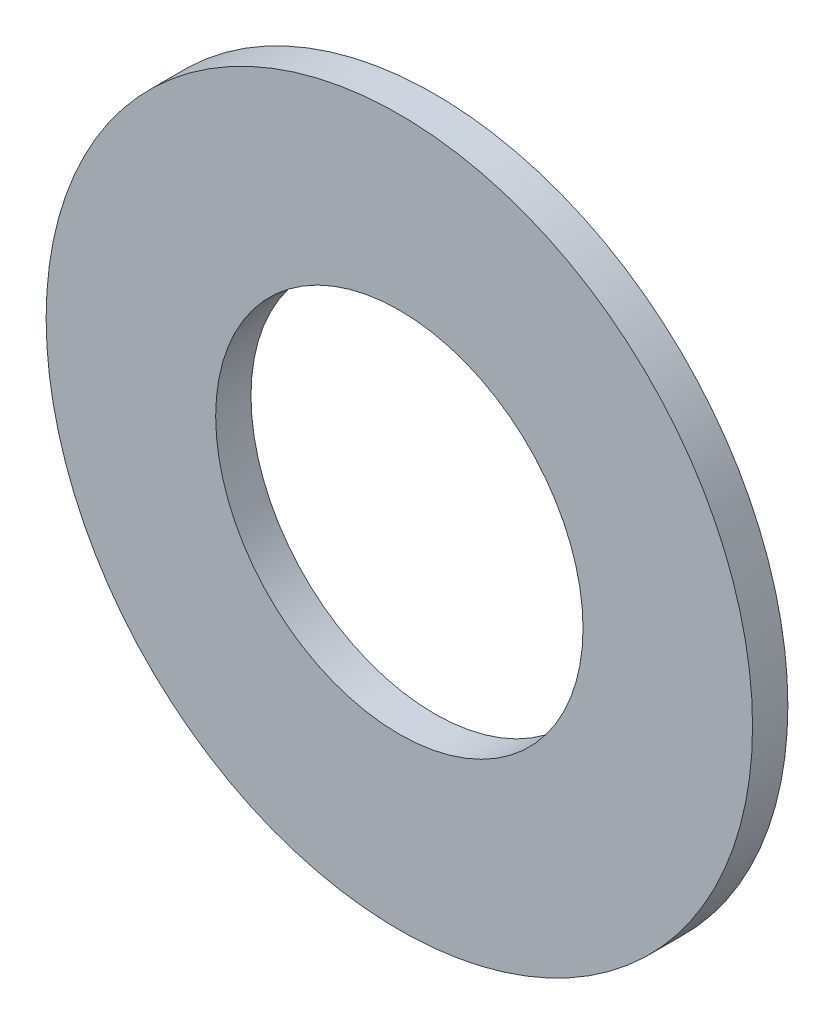
ISO-10303-21;
HEADER;
FILE_DESCRIPTION(('STEP AP214'),'2;1');
FILE_NAME('part.step','',(''),(''),'','','');
FILE_SCHEMA(('AUTOMOTIVE_DESIGN { 1 0 10303 214 1 1 1 1 }'));
ENDSEC;
DATA;
#1=APPLICATION_CONTEXT('core data for automotive mechanical design processes');
#2=APPLICATION_PROTOCOL_DEFINITION('international standard','automotive_design',2000,#1);
#3=PRODUCT_CONTEXT('',#1,'mechanical');
#4=PRODUCT('Part','Part','',(#3));
#5=PRODUCT_RELATED_PRODUCT_CATEGORY('part','',(#4));
#6=PRODUCT_DEFINITION_FORMATION('','',#4);
#7=PRODUCT_DEFINITION_CONTEXT('part definition',#1,'design');
#8=PRODUCT_DEFINITION('design','',#6,#7);
#9=PRODUCT_DEFINITION_SHAPE('','',#8);
#10=(LENGTH_UNIT() NAMED_UNIT(*) SI_UNIT(.MILLI.,.METRE.));
#11=(NAMED_UNIT(*) PLANE_ANGLE_UNIT() SI_UNIT($,.RADIAN.));
#12=(NAMED_UNIT(*) SI_UNIT($,.STERADIAN.) SOLID_ANGLE_UNIT());
#13=UNCERTAINTY_MEASURE_WITH_UNIT(LENGTH_MEASURE(1.E-05),#10,'distance_accuracy_value','');
#14=(GEOMETRIC_REPRESENTATION_CONTEXT(3) GLOBAL_UNCERTAINTY_ASSIGNED_CONTEXT((#13)) GLOBAL_UNIT_ASSIGNED_CONTEXT((#10,
#11,#12)) REPRESENTATION_CONTEXT('',''));
#15=CARTESIAN_POINT('',(0.,0.,0.));
#16=DIRECTION('',(0.,0.,1.));
#17=DIRECTION('',(1.,0.,0.));
#18=AXIS2_PLACEMENT_3D('',#15,#16,#17);
#19=CARTESIAN_POINT('',(0.,0.,0.5));
#20=DIRECTION('',(0.,0.,1.));
#21=DIRECTION('',(1.,0.,0.));
#22=AXIS2_PLACEMENT_3D('',#19,#20,#21);
#23=PLANE('',#22);
#24=CARTESIAN_POINT('',(0.,0.,0.5));
#25=DIRECTION('',(0.,0.,1.));
#26=DIRECTION('',(1.,0.,0.));
#27=AXIS2_PLACEMENT_3D('',#24,#25,#26);
#28=CIRCLE('',#27,5.);
#29=CARTESIAN_POINT('',(5.,0.,0.5));
#30=VERTEX_POINT('',#29);
#31=EDGE_CURVE('E10',#30,#30,#28,.T.);
#32=ORIENTED_EDGE('',*,*,#31,.T.);
#33=EDGE_LOOP('',(#32));
#34=FACE_BOUND('',#33,.T.);
#35=CARTESIAN_POINT('',(0.,0.,0.5));
#36=DIRECTION('',(0.,0.,1.));
#37=DIRECTION('',(1.,0.,0.));
#38=AXIS2_PLACEMENT_3D('',#35,#36,#37);
#39=CIRCLE('',#38,2.6);
#40=CARTESIAN_POINT('',(2.6,0.,0.5));
#41=VERTEX_POINT('',#40);
#42=EDGE_CURVE('E48',#41,#41,#39,.T.);
#43=ORIENTED_EDGE('',*,*,#42,.F.);
#44=EDGE_LOOP('',(#43));
#45=FACE_BOUND('',#44,.T.);
#46=ADVANCED_FACE('F34',(#34,#45),#23,.T.);
#47=CARTESIAN_POINT('',(0.,0.,0.));
#48=DIRECTION('',(0.,0.,1.));
#49=DIRECTION('',(1.,0.,0.));
#50=AXIS2_PLACEMENT_3D('',#47,#48,#49);
#51=PLANE('',#50);
#52=CARTESIAN_POINT('',(0.,0.,0.));
#53=DIRECTION('',(0.,0.,1.));
#54=DIRECTION('',(1.,0.,0.));
#55=AXIS2_PLACEMENT_3D('',#52,#53,#54);
#56=CIRCLE('',#55,5.);
#57=CARTESIAN_POINT('',(5.,0.,0.));
#58=VERTEX_POINT('',#57);
#59=EDGE_CURVE('E38',#58,#58,#56,.T.);
#60=ORIENTED_EDGE('',*,*,#59,.F.);
#61=EDGE_LOOP('',(#60));
#62=FACE_BOUND('',#61,.T.);
#63=CARTESIAN_POINT('',(0.,0.,0.));
#64=DIRECTION('',(0.,0.,1.));
#65=DIRECTION('',(1.,0.,0.));
#66=AXIS2_PLACEMENT_3D('',#63,#64,#65);
#67=CIRCLE('',#66,2.6);
#68=CARTESIAN_POINT('',(2.6,0.,0.));
#69=VERTEX_POINT('',#68);
#70=EDGE_CURVE('E50',#69,#69,#67,.T.);
#71=ORIENTED_EDGE('',*,*,#70,.T.);
#72=EDGE_LOOP('',(#71));
#73=FACE_BOUND('',#72,.T.);
#74=ADVANCED_FACE('F63',(#62,#73),#51,.F.);
#75=CARTESIAN_POINT('',(0.,0.,0.5));
#76=DIRECTION('',(0.,0.,-1.));
#77=DIRECTION('',(-1.,0.,0.));
#78=AXIS2_PLACEMENT_3D('',#75,#76,#77);
#79=CYLINDRICAL_SURFACE('',#78,5.);
#80=ORIENTED_EDGE('',*,*,#31,.F.);
#81=EDGE_LOOP('',(#80));
#82=FACE_BOUND('',#81,.T.);
#83=ORIENTED_EDGE('',*,*,#59,.T.);
#84=EDGE_LOOP('',(#83));
#85=FACE_BOUND('',#84,.T.);
#86=ADVANCED_FACE('F36',(#82,#85),#79,.T.);
#87=CARTESIAN_POINT('',(0.,0.,0.5));
#88=DIRECTION('',(0.,0.,-1.));
#89=DIRECTION('',(-1.,0.,0.));
#90=AXIS2_PLACEMENT_3D('',#87,#88,#89);
#91=CYLINDRICAL_SURFACE('',#90,2.6);
#92=ORIENTED_EDGE('',*,*,#42,.T.);
#93=EDGE_LOOP('',(#92));
#94=FACE_BOUND('',#93,.T.);
#95=ORIENTED_EDGE('',*,*,#70,.F.);
#96=EDGE_LOOP('',(#95));
#97=FACE_BOUND('',#96,.T.);
#98=ADVANCED_FACE('F59',(#94,#97),#91,.F.);
#99=CLOSED_SHELL('',(#46,#74,#86,#98));
#100=MANIFOLD_SOLID_BREP('B2',#99);
#101=ADVANCED_BREP_SHAPE_REPRESENTATION('',(#18,#100),#14);
#102=SHAPE_DEFINITION_REPRESENTATION(#9,#101);
ENDSEC;
END-ISO-10303-21;
